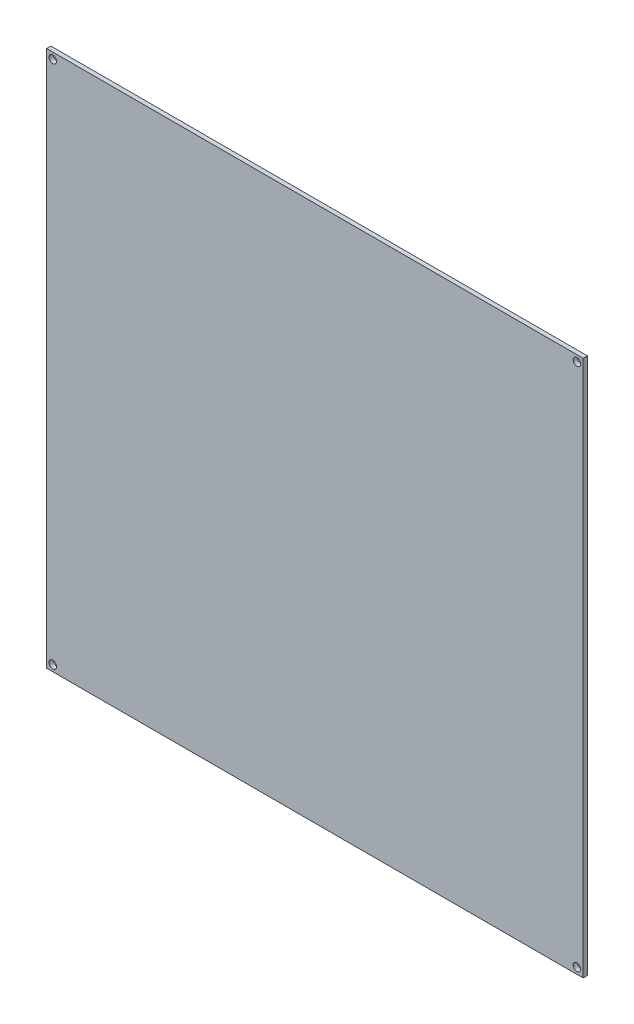
ISO-10303-21;
HEADER;
FILE_DESCRIPTION(('STEP AP214'),'2;1');
FILE_NAME('part.step','',(''),(''),'','','');
FILE_SCHEMA(('AUTOMOTIVE_DESIGN { 1 0 10303 214 1 1 1 1 }'));
ENDSEC;
DATA;
#1=APPLICATION_CONTEXT('core data for automotive mechanical design processes');
#2=APPLICATION_PROTOCOL_DEFINITION('international standard','automotive_design',2000,#1);
#3=PRODUCT_CONTEXT('',#1,'mechanical');
#4=PRODUCT('Part','Part','',(#3));
#5=PRODUCT_RELATED_PRODUCT_CATEGORY('part','',(#4));
#6=PRODUCT_DEFINITION_FORMATION('','',#4);
#7=PRODUCT_DEFINITION_CONTEXT('part definition',#1,'design');
#8=PRODUCT_DEFINITION('design','',#6,#7);
#9=PRODUCT_DEFINITION_SHAPE('','',#8);
#10=(LENGTH_UNIT() NAMED_UNIT(*) SI_UNIT(.MILLI.,.METRE.));
#11=(NAMED_UNIT(*) PLANE_ANGLE_UNIT() SI_UNIT($,.RADIAN.));
#12=(NAMED_UNIT(*) SI_UNIT($,.STERADIAN.) SOLID_ANGLE_UNIT());
#13=UNCERTAINTY_MEASURE_WITH_UNIT(LENGTH_MEASURE(1.E-05),#10,'distance_accuracy_value','');
#14=(GEOMETRIC_REPRESENTATION_CONTEXT(3) GLOBAL_UNCERTAINTY_ASSIGNED_CONTEXT((#13)) GLOBAL_UNIT_ASSIGNED_CONTEXT((#10,
#11,#12)) REPRESENTATION_CONTEXT('',''));
#15=CARTESIAN_POINT('',(0.,0.,0.));
#16=DIRECTION('',(0.,0.,1.));
#17=DIRECTION('',(1.,0.,0.));
#18=AXIS2_PLACEMENT_3D('',#15,#16,#17);
#19=CARTESIAN_POINT('',(0.,0.,-1.7));
#20=DIRECTION('',(-1.,0.,0.));
#21=DIRECTION('',(0.,0.,1.));
#22=AXIS2_PLACEMENT_3D('',#19,#20,#21);
#23=PLANE('',#22);
#24=DIRECTION('',(0.,-1.,0.));
#25=VECTOR('',#24,1.);
#26=CARTESIAN_POINT('',(0.,0.,0.));
#27=LINE('',#26,#25);
#28=CARTESIAN_POINT('',(0.,214.,0.));
#29=VERTEX_POINT('',#28);
#30=CARTESIAN_POINT('',(0.,0.,0.));
#31=VERTEX_POINT('',#30);
#32=EDGE_CURVE('E98',#29,#31,#27,.T.);
#33=ORIENTED_EDGE('',*,*,#32,.F.);
#34=DIRECTION('',(0.,0.,1.));
#35=VECTOR('',#34,1.);
#36=CARTESIAN_POINT('',(0.,214.,-1.7));
#37=LINE('',#36,#35);
#38=CARTESIAN_POINT('',(0.,214.,-1.7));
#39=VERTEX_POINT('',#38);
#40=EDGE_CURVE('E11',#39,#29,#37,.T.);
#41=ORIENTED_EDGE('',*,*,#40,.F.);
#42=DIRECTION('',(0.,-1.,0.));
#43=VECTOR('',#42,1.);
#44=CARTESIAN_POINT('',(0.,0.,-1.7));
#45=LINE('',#44,#43);
#46=CARTESIAN_POINT('',(0.,0.,-1.7));
#47=VERTEX_POINT('',#46);
#48=EDGE_CURVE('E91',#39,#47,#45,.T.);
#49=ORIENTED_EDGE('',*,*,#48,.T.);
#50=DIRECTION('',(0.,0.,1.));
#51=VECTOR('',#50,1.);
#52=CARTESIAN_POINT('',(0.,0.,-1.7));
#53=LINE('',#52,#51);
#54=EDGE_CURVE('E36',#47,#31,#53,.T.);
#55=ORIENTED_EDGE('',*,*,#54,.T.);
#56=EDGE_LOOP('',(#33,#41,#49,#55));
#57=FACE_BOUND('',#56,.T.);
#58=ADVANCED_FACE('F33',(#57),#23,.T.);
#59=CARTESIAN_POINT('',(0.,214.,-1.7));
#60=DIRECTION('',(0.,1.,0.));
#61=DIRECTION('',(0.,0.,1.));
#62=AXIS2_PLACEMENT_3D('',#59,#60,#61);
#63=PLANE('',#62);
#64=DIRECTION('',(-1.,0.,0.));
#65=VECTOR('',#64,1.);
#66=CARTESIAN_POINT('',(0.,214.,0.));
#67=LINE('',#66,#65);
#68=CARTESIAN_POINT('',(214.,214.,0.));
#69=VERTEX_POINT('',#68);
#70=EDGE_CURVE('E93',#69,#29,#67,.T.);
#71=ORIENTED_EDGE('',*,*,#70,.F.);
#72=DIRECTION('',(0.,0.,1.));
#73=VECTOR('',#72,1.);
#74=CARTESIAN_POINT('',(214.,214.,-1.7));
#75=LINE('',#74,#73);
#76=CARTESIAN_POINT('',(214.,214.,-1.7));
#77=VERTEX_POINT('',#76);
#78=EDGE_CURVE('E42',#77,#69,#75,.T.);
#79=ORIENTED_EDGE('',*,*,#78,.F.);
#80=DIRECTION('',(-1.,0.,0.));
#81=VECTOR('',#80,1.);
#82=CARTESIAN_POINT('',(0.,214.,-1.7));
#83=LINE('',#82,#81);
#84=EDGE_CURVE('E88',#77,#39,#83,.T.);
#85=ORIENTED_EDGE('',*,*,#84,.T.);
#86=ORIENTED_EDGE('',*,*,#40,.T.);
#87=EDGE_LOOP('',(#71,#79,#85,#86));
#88=FACE_BOUND('',#87,.T.);
#89=ADVANCED_FACE('F109',(#88),#63,.T.);
#90=CARTESIAN_POINT('',(214.,0.,-1.7));
#91=DIRECTION('',(1.,0.,0.));
#92=DIRECTION('',(0.,0.,-1.));
#93=AXIS2_PLACEMENT_3D('',#90,#91,#92);
#94=PLANE('',#93);
#95=DIRECTION('',(0.,1.,0.));
#96=VECTOR('',#95,1.);
#97=CARTESIAN_POINT('',(214.,0.,0.));
#98=LINE('',#97,#96);
#99=CARTESIAN_POINT('',(214.,0.,0.));
#100=VERTEX_POINT('',#99);
#101=EDGE_CURVE('E83',#100,#69,#98,.T.);
#102=ORIENTED_EDGE('',*,*,#101,.F.);
#103=DIRECTION('',(0.,0.,1.));
#104=VECTOR('',#103,1.);
#105=CARTESIAN_POINT('',(214.,0.,-1.7));
#106=LINE('',#105,#104);
#107=CARTESIAN_POINT('',(214.,0.,-1.7));
#108=VERTEX_POINT('',#107);
#109=EDGE_CURVE('E78',#108,#100,#106,.T.);
#110=ORIENTED_EDGE('',*,*,#109,.F.);
#111=DIRECTION('',(0.,1.,0.));
#112=VECTOR('',#111,1.);
#113=CARTESIAN_POINT('',(214.,0.,-1.7));
#114=LINE('',#113,#112);
#115=EDGE_CURVE('E81',#108,#77,#114,.T.);
#116=ORIENTED_EDGE('',*,*,#115,.T.);
#117=ORIENTED_EDGE('',*,*,#78,.T.);
#118=EDGE_LOOP('',(#102,#110,#116,#117));
#119=FACE_BOUND('',#118,.T.);
#120=ADVANCED_FACE('F80',(#119),#94,.T.);
#121=CARTESIAN_POINT('',(0.,0.,-1.7));
#122=DIRECTION('',(0.,-1.,0.));
#123=DIRECTION('',(0.,0.,-1.));
#124=AXIS2_PLACEMENT_3D('',#121,#122,#123);
#125=PLANE('',#124);
#126=DIRECTION('',(1.,0.,0.));
#127=VECTOR('',#126,1.);
#128=CARTESIAN_POINT('',(0.,0.,0.));
#129=LINE('',#128,#127);
#130=EDGE_CURVE('E101',#31,#100,#129,.T.);
#131=ORIENTED_EDGE('',*,*,#130,.F.);
#132=ORIENTED_EDGE('',*,*,#54,.F.);
#133=DIRECTION('',(1.,0.,0.));
#134=VECTOR('',#133,1.);
#135=CARTESIAN_POINT('',(0.,0.,-1.7));
#136=LINE('',#135,#134);
#137=EDGE_CURVE('E87',#47,#108,#136,.T.);
#138=ORIENTED_EDGE('',*,*,#137,.T.);
#139=ORIENTED_EDGE('',*,*,#109,.T.);
#140=EDGE_LOOP('',(#131,#132,#138,#139));
#141=FACE_BOUND('',#140,.T.);
#142=ADVANCED_FACE('F90',(#141),#125,.T.);
#143=CARTESIAN_POINT('',(0.,0.,-1.7));
#144=DIRECTION('',(0.,0.,-1.));
#145=DIRECTION('',(-1.,0.,0.));
#146=AXIS2_PLACEMENT_3D('',#143,#144,#145);
#147=PLANE('',#146);
#148=CARTESIAN_POINT('',(2.5,2.49999999999995,-1.7));
#149=DIRECTION('',(0.,0.,1.));
#150=DIRECTION('',(-1.,0.,0.));
#151=AXIS2_PLACEMENT_3D('',#148,#149,#150);
#152=CIRCLE('',#151,1.5);
#153=CARTESIAN_POINT('',(1.,2.49999999999995,-1.7));
#154=VERTEX_POINT('',#153);
#155=EDGE_CURVE('E150',#154,#154,#152,.T.);
#156=ORIENTED_EDGE('',*,*,#155,.T.);
#157=EDGE_LOOP('',(#156));
#158=FACE_BOUND('',#157,.T.);
#159=CARTESIAN_POINT('',(211.5,2.49999999999995,-1.7));
#160=DIRECTION('',(0.,0.,1.));
#161=DIRECTION('',(1.,0.,0.));
#162=AXIS2_PLACEMENT_3D('',#159,#160,#161);
#163=CIRCLE('',#162,1.5);
#164=CARTESIAN_POINT('',(213.,2.49999999999995,-1.7));
#165=VERTEX_POINT('',#164);
#166=EDGE_CURVE('E158',#165,#165,#163,.T.);
#167=ORIENTED_EDGE('',*,*,#166,.T.);
#168=EDGE_LOOP('',(#167));
#169=FACE_BOUND('',#168,.T.);
#170=CARTESIAN_POINT('',(211.5,211.5,-1.7));
#171=DIRECTION('',(0.,0.,1.));
#172=DIRECTION('',(-1.,0.,0.));
#173=AXIS2_PLACEMENT_3D('',#170,#171,#172);
#174=CIRCLE('',#173,1.5);
#175=CARTESIAN_POINT('',(210.,211.5,-1.7));
#176=VERTEX_POINT('',#175);
#177=EDGE_CURVE('E164',#176,#176,#174,.T.);
#178=ORIENTED_EDGE('',*,*,#177,.T.);
#179=EDGE_LOOP('',(#178));
#180=FACE_BOUND('',#179,.T.);
#181=CARTESIAN_POINT('',(2.5,211.5,-1.7));
#182=DIRECTION('',(0.,0.,1.));
#183=DIRECTION('',(1.,0.,0.));
#184=AXIS2_PLACEMENT_3D('',#181,#182,#183);
#185=CIRCLE('',#184,1.5);
#186=CARTESIAN_POINT('',(4.,211.5,-1.7));
#187=VERTEX_POINT('',#186);
#188=EDGE_CURVE('E102',#187,#187,#185,.T.);
#189=ORIENTED_EDGE('',*,*,#188,.T.);
#190=EDGE_LOOP('',(#189));
#191=FACE_BOUND('',#190,.T.);
#192=ORIENTED_EDGE('',*,*,#48,.F.);
#193=ORIENTED_EDGE('',*,*,#84,.F.);
#194=ORIENTED_EDGE('',*,*,#115,.F.);
#195=ORIENTED_EDGE('',*,*,#137,.F.);
#196=EDGE_LOOP('',(#192,#193,#194,#195));
#197=FACE_BOUND('',#196,.T.);
#198=ADVANCED_FACE('F86',(#158,#169,#180,#191,#197),#147,.T.);
#199=CARTESIAN_POINT('',(0.,0.,0.));
#200=DIRECTION('',(0.,0.,-1.));
#201=DIRECTION('',(-1.,0.,0.));
#202=AXIS2_PLACEMENT_3D('',#199,#200,#201);
#203=PLANE('',#202);
#204=CARTESIAN_POINT('',(2.5,2.49999999999995,0.));
#205=DIRECTION('',(0.,0.,1.));
#206=DIRECTION('',(-1.,0.,0.));
#207=AXIS2_PLACEMENT_3D('',#204,#205,#206);
#208=CIRCLE('',#207,1.5);
#209=CARTESIAN_POINT('',(1.,2.49999999999995,0.));
#210=VERTEX_POINT('',#209);
#211=EDGE_CURVE('E153',#210,#210,#208,.T.);
#212=ORIENTED_EDGE('',*,*,#211,.F.);
#213=EDGE_LOOP('',(#212));
#214=FACE_BOUND('',#213,.T.);
#215=CARTESIAN_POINT('',(211.5,2.49999999999995,0.));
#216=DIRECTION('',(0.,0.,1.));
#217=DIRECTION('',(1.,0.,0.));
#218=AXIS2_PLACEMENT_3D('',#215,#216,#217);
#219=CIRCLE('',#218,1.5);
#220=CARTESIAN_POINT('',(213.,2.49999999999995,0.));
#221=VERTEX_POINT('',#220);
#222=EDGE_CURVE('E155',#221,#221,#219,.T.);
#223=ORIENTED_EDGE('',*,*,#222,.F.);
#224=EDGE_LOOP('',(#223));
#225=FACE_BOUND('',#224,.T.);
#226=CARTESIAN_POINT('',(211.5,211.5,0.));
#227=DIRECTION('',(0.,0.,1.));
#228=DIRECTION('',(-1.,0.,0.));
#229=AXIS2_PLACEMENT_3D('',#226,#227,#228);
#230=CIRCLE('',#229,1.5);
#231=CARTESIAN_POINT('',(210.,211.5,0.));
#232=VERTEX_POINT('',#231);
#233=EDGE_CURVE('E161',#232,#232,#230,.T.);
#234=ORIENTED_EDGE('',*,*,#233,.F.);
#235=EDGE_LOOP('',(#234));
#236=FACE_BOUND('',#235,.T.);
#237=CARTESIAN_POINT('',(2.5,211.5,0.));
#238=DIRECTION('',(0.,0.,1.));
#239=DIRECTION('',(1.,0.,0.));
#240=AXIS2_PLACEMENT_3D('',#237,#238,#239);
#241=CIRCLE('',#240,1.5);
#242=CARTESIAN_POINT('',(4.,211.5,0.));
#243=VERTEX_POINT('',#242);
#244=EDGE_CURVE('E167',#243,#243,#241,.T.);
#245=ORIENTED_EDGE('',*,*,#244,.F.);
#246=EDGE_LOOP('',(#245));
#247=FACE_BOUND('',#246,.T.);
#248=ORIENTED_EDGE('',*,*,#32,.T.);
#249=ORIENTED_EDGE('',*,*,#130,.T.);
#250=ORIENTED_EDGE('',*,*,#101,.T.);
#251=ORIENTED_EDGE('',*,*,#70,.T.);
#252=EDGE_LOOP('',(#248,#249,#250,#251));
#253=FACE_BOUND('',#252,.T.);
#254=ADVANCED_FACE('F108',(#214,#225,#236,#247,#253),#203,.F.);
#255=CARTESIAN_POINT('',(2.5,211.5,-1.7));
#256=DIRECTION('',(0.,0.,1.));
#257=DIRECTION('',(1.,0.,0.));
#258=AXIS2_PLACEMENT_3D('',#255,#256,#257);
#259=CYLINDRICAL_SURFACE('',#258,1.5);
#260=ORIENTED_EDGE('',*,*,#188,.F.);
#261=EDGE_LOOP('',(#260));
#262=FACE_BOUND('',#261,.T.);
#263=ORIENTED_EDGE('',*,*,#244,.T.);
#264=EDGE_LOOP('',(#263));
#265=FACE_BOUND('',#264,.T.);
#266=ADVANCED_FACE('F127',(#262,#265),#259,.F.);
#267=CARTESIAN_POINT('',(211.5,211.5,-1.7));
#268=DIRECTION('',(0.,0.,1.));
#269=DIRECTION('',(1.,0.,0.));
#270=AXIS2_PLACEMENT_3D('',#267,#268,#269);
#271=CYLINDRICAL_SURFACE('',#270,1.5);
#272=ORIENTED_EDGE('',*,*,#177,.F.);
#273=EDGE_LOOP('',(#272));
#274=FACE_BOUND('',#273,.T.);
#275=ORIENTED_EDGE('',*,*,#233,.T.);
#276=EDGE_LOOP('',(#275));
#277=FACE_BOUND('',#276,.T.);
#278=ADVANCED_FACE('F134',(#274,#277),#271,.F.);
#279=CARTESIAN_POINT('',(211.5,2.49999999999995,-1.7));
#280=DIRECTION('',(0.,0.,1.));
#281=DIRECTION('',(1.,0.,0.));
#282=AXIS2_PLACEMENT_3D('',#279,#280,#281);
#283=CYLINDRICAL_SURFACE('',#282,1.5);
#284=ORIENTED_EDGE('',*,*,#166,.F.);
#285=EDGE_LOOP('',(#284));
#286=FACE_BOUND('',#285,.T.);
#287=ORIENTED_EDGE('',*,*,#222,.T.);
#288=EDGE_LOOP('',(#287));
#289=FACE_BOUND('',#288,.T.);
#290=ADVANCED_FACE('F138',(#286,#289),#283,.F.);
#291=CARTESIAN_POINT('',(2.5,2.49999999999995,-1.7));
#292=DIRECTION('',(0.,0.,1.));
#293=DIRECTION('',(1.,0.,0.));
#294=AXIS2_PLACEMENT_3D('',#291,#292,#293);
#295=CYLINDRICAL_SURFACE('',#294,1.5);
#296=ORIENTED_EDGE('',*,*,#155,.F.);
#297=EDGE_LOOP('',(#296));
#298=FACE_BOUND('',#297,.T.);
#299=ORIENTED_EDGE('',*,*,#211,.T.);
#300=EDGE_LOOP('',(#299));
#301=FACE_BOUND('',#300,.T.);
#302=ADVANCED_FACE('F142',(#298,#301),#295,.F.);
#303=CLOSED_SHELL('',(#58,#89,#120,#142,#198,#254,#266,#278,#290,#302));
#304=MANIFOLD_SOLID_BREP('B2',#303);
#305=ADVANCED_BREP_SHAPE_REPRESENTATION('',(#18,#304),#14);
#306=SHAPE_DEFINITION_REPRESENTATION(#9,#305);
ENDSEC;
END-ISO-10303-21;
